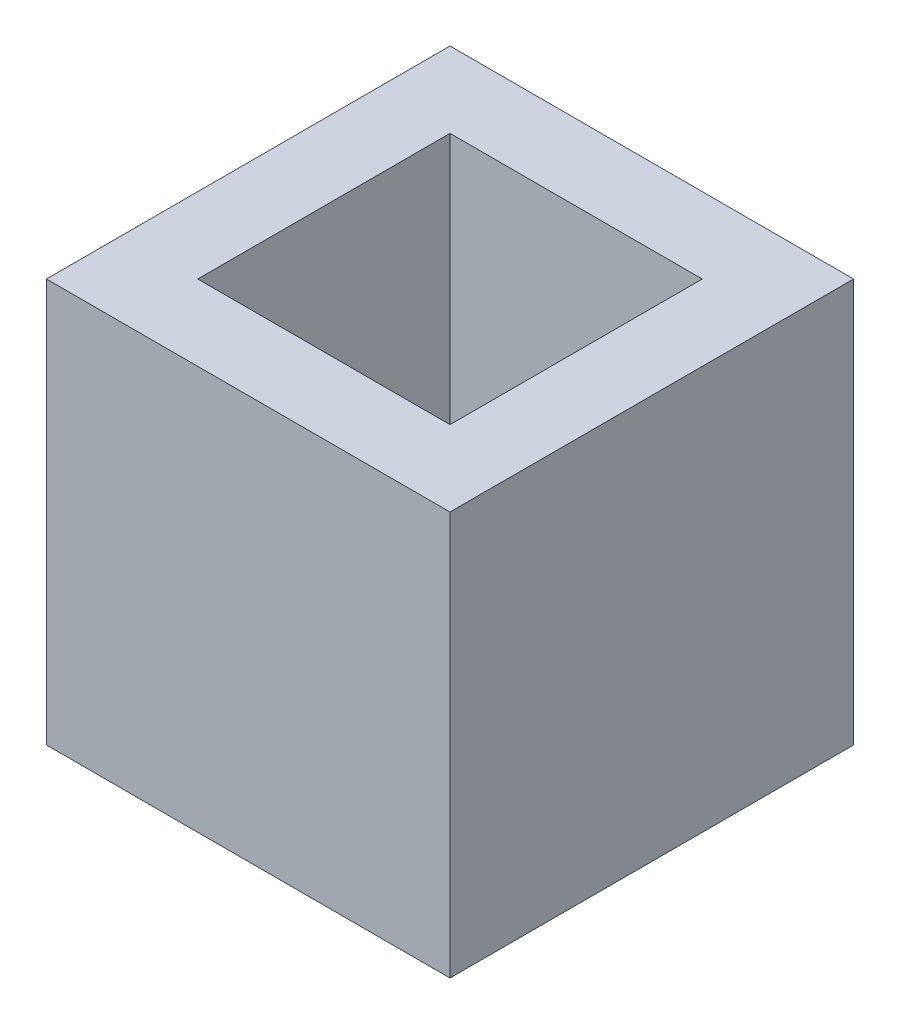
ISO-10303-21;
HEADER;
FILE_DESCRIPTION(('STEP AP214'),'2;1');
FILE_NAME('part.step','',(''),(''),'','','');
FILE_SCHEMA(('AUTOMOTIVE_DESIGN { 1 0 10303 214 1 1 1 1 }'));
ENDSEC;
DATA;
#1=APPLICATION_CONTEXT('core data for automotive mechanical design processes');
#2=APPLICATION_PROTOCOL_DEFINITION('international standard','automotive_design',2000,#1);
#3=PRODUCT_CONTEXT('',#1,'mechanical');
#4=PRODUCT('Part','Part','',(#3));
#5=PRODUCT_RELATED_PRODUCT_CATEGORY('part','',(#4));
#6=PRODUCT_DEFINITION_FORMATION('','',#4);
#7=PRODUCT_DEFINITION_CONTEXT('part definition',#1,'design');
#8=PRODUCT_DEFINITION('design','',#6,#7);
#9=PRODUCT_DEFINITION_SHAPE('','',#8);
#10=(LENGTH_UNIT() NAMED_UNIT(*) SI_UNIT(.MILLI.,.METRE.));
#11=(NAMED_UNIT(*) PLANE_ANGLE_UNIT() SI_UNIT($,.RADIAN.));
#12=(NAMED_UNIT(*) SI_UNIT($,.STERADIAN.) SOLID_ANGLE_UNIT());
#13=UNCERTAINTY_MEASURE_WITH_UNIT(LENGTH_MEASURE(1.E-05),#10,'distance_accuracy_value','');
#14=(GEOMETRIC_REPRESENTATION_CONTEXT(3) GLOBAL_UNCERTAINTY_ASSIGNED_CONTEXT((#13)) GLOBAL_UNIT_ASSIGNED_CONTEXT((#10,
#11,#12)) REPRESENTATION_CONTEXT('',''));
#15=CARTESIAN_POINT('',(0.,0.,0.));
#16=DIRECTION('',(0.,0.,1.));
#17=DIRECTION('',(1.,0.,0.));
#18=AXIS2_PLACEMENT_3D('',#15,#16,#17);
#19=CARTESIAN_POINT('',(0.,25.4,0.));
#20=DIRECTION('',(1.,0.,0.));
#21=DIRECTION('',(0.,0.,-1.));
#22=AXIS2_PLACEMENT_3D('',#19,#20,#21);
#23=PLANE('',#22);
#24=DIRECTION('',(0.,0.,1.));
#25=VECTOR('',#24,1.);
#26=CARTESIAN_POINT('',(0.,0.,0.));
#27=LINE('',#26,#25);
#28=CARTESIAN_POINT('',(0.,0.,-25.4));
#29=VERTEX_POINT('',#28);
#30=CARTESIAN_POINT('',(0.,0.,0.));
#31=VERTEX_POINT('',#30);
#32=EDGE_CURVE('E130',#29,#31,#27,.T.);
#33=ORIENTED_EDGE('',*,*,#32,.T.);
#34=DIRECTION('',(0.,-1.,0.));
#35=VECTOR('',#34,1.);
#36=CARTESIAN_POINT('',(0.,25.4,0.));
#37=LINE('',#36,#35);
#38=CARTESIAN_POINT('',(0.,25.4,0.));
#39=VERTEX_POINT('',#38);
#40=EDGE_CURVE('E11',#39,#31,#37,.T.);
#41=ORIENTED_EDGE('',*,*,#40,.F.);
#42=DIRECTION('',(0.,0.,1.));
#43=VECTOR('',#42,1.);
#44=CARTESIAN_POINT('',(0.,25.4,0.));
#45=LINE('',#44,#43);
#46=CARTESIAN_POINT('',(0.,25.4,-25.4));
#47=VERTEX_POINT('',#46);
#48=EDGE_CURVE('E134',#47,#39,#45,.T.);
#49=ORIENTED_EDGE('',*,*,#48,.F.);
#50=DIRECTION('',(0.,-1.,0.));
#51=VECTOR('',#50,1.);
#52=CARTESIAN_POINT('',(0.,25.4,-25.4));
#53=LINE('',#52,#51);
#54=EDGE_CURVE('E144',#47,#29,#53,.T.);
#55=ORIENTED_EDGE('',*,*,#54,.T.);
#56=EDGE_LOOP('',(#33,#41,#49,#55));
#57=FACE_BOUND('',#56,.T.);
#58=ADVANCED_FACE('F33',(#57),#23,.F.);
#59=CARTESIAN_POINT('',(0.,25.4,0.));
#60=DIRECTION('',(0.,0.,-1.));
#61=DIRECTION('',(-1.,0.,0.));
#62=AXIS2_PLACEMENT_3D('',#59,#60,#61);
#63=PLANE('',#62);
#64=DIRECTION('',(1.,0.,0.));
#65=VECTOR('',#64,1.);
#66=CARTESIAN_POINT('',(0.,0.,0.));
#67=LINE('',#66,#65);
#68=CARTESIAN_POINT('',(25.4,0.,0.));
#69=VERTEX_POINT('',#68);
#70=EDGE_CURVE('E147',#31,#69,#67,.T.);
#71=ORIENTED_EDGE('',*,*,#70,.T.);
#72=DIRECTION('',(0.,-1.,0.));
#73=VECTOR('',#72,1.);
#74=CARTESIAN_POINT('',(25.4,25.4,0.));
#75=LINE('',#74,#73);
#76=CARTESIAN_POINT('',(25.4,25.4,0.));
#77=VERTEX_POINT('',#76);
#78=EDGE_CURVE('E40',#77,#69,#75,.T.);
#79=ORIENTED_EDGE('',*,*,#78,.F.);
#80=DIRECTION('',(1.,0.,0.));
#81=VECTOR('',#80,1.);
#82=CARTESIAN_POINT('',(0.,25.4,0.));
#83=LINE('',#82,#81);
#84=EDGE_CURVE('E137',#39,#77,#83,.T.);
#85=ORIENTED_EDGE('',*,*,#84,.F.);
#86=ORIENTED_EDGE('',*,*,#40,.T.);
#87=EDGE_LOOP('',(#71,#79,#85,#86));
#88=FACE_BOUND('',#87,.T.);
#89=ADVANCED_FACE('F175',(#88),#63,.F.);
#90=CARTESIAN_POINT('',(25.4,25.4,0.));
#91=DIRECTION('',(-1.,0.,0.));
#92=DIRECTION('',(0.,0.,1.));
#93=AXIS2_PLACEMENT_3D('',#90,#91,#92);
#94=PLANE('',#93);
#95=DIRECTION('',(0.,0.,-1.));
#96=VECTOR('',#95,1.);
#97=CARTESIAN_POINT('',(25.4,0.,0.));
#98=LINE('',#97,#96);
#99=CARTESIAN_POINT('',(25.4,0.,-25.4));
#100=VERTEX_POINT('',#99);
#101=EDGE_CURVE('E149',#69,#100,#98,.T.);
#102=ORIENTED_EDGE('',*,*,#101,.T.);
#103=DIRECTION('',(0.,-1.,0.));
#104=VECTOR('',#103,1.);
#105=CARTESIAN_POINT('',(25.4,25.4,-25.4));
#106=LINE('',#105,#104);
#107=CARTESIAN_POINT('',(25.4,25.4,-25.4));
#108=VERTEX_POINT('',#107);
#109=EDGE_CURVE('E154',#108,#100,#106,.T.);
#110=ORIENTED_EDGE('',*,*,#109,.F.);
#111=DIRECTION('',(0.,0.,-1.));
#112=VECTOR('',#111,1.);
#113=CARTESIAN_POINT('',(25.4,25.4,0.));
#114=LINE('',#113,#112);
#115=EDGE_CURVE('E140',#77,#108,#114,.T.);
#116=ORIENTED_EDGE('',*,*,#115,.F.);
#117=ORIENTED_EDGE('',*,*,#78,.T.);
#118=EDGE_LOOP('',(#102,#110,#116,#117));
#119=FACE_BOUND('',#118,.T.);
#120=ADVANCED_FACE('F161',(#119),#94,.F.);
#121=CARTESIAN_POINT('',(0.,25.4,-25.4));
#122=DIRECTION('',(0.,0.,1.));
#123=DIRECTION('',(1.,0.,0.));
#124=AXIS2_PLACEMENT_3D('',#121,#122,#123);
#125=PLANE('',#124);
#126=DIRECTION('',(-1.,0.,0.));
#127=VECTOR('',#126,1.);
#128=CARTESIAN_POINT('',(0.,0.,-25.4));
#129=LINE('',#128,#127);
#130=EDGE_CURVE('E138',#100,#29,#129,.T.);
#131=ORIENTED_EDGE('',*,*,#130,.T.);
#132=ORIENTED_EDGE('',*,*,#54,.F.);
#133=DIRECTION('',(-1.,0.,0.));
#134=VECTOR('',#133,1.);
#135=CARTESIAN_POINT('',(0.,25.4,-25.4));
#136=LINE('',#135,#134);
#137=EDGE_CURVE('E142',#108,#47,#136,.T.);
#138=ORIENTED_EDGE('',*,*,#137,.F.);
#139=ORIENTED_EDGE('',*,*,#109,.T.);
#140=EDGE_LOOP('',(#131,#132,#138,#139));
#141=FACE_BOUND('',#140,.T.);
#142=ADVANCED_FACE('F168',(#141),#125,.F.);
#143=CARTESIAN_POINT('',(0.,25.4,0.));
#144=DIRECTION('',(0.,-1.,0.));
#145=DIRECTION('',(0.,0.,-1.));
#146=AXIS2_PLACEMENT_3D('',#143,#144,#145);
#147=PLANE('',#146);
#148=DIRECTION('',(-1.,0.,0.));
#149=VECTOR('',#148,1.);
#150=CARTESIAN_POINT('',(4.7625,25.4,-20.6375));
#151=LINE('',#150,#149);
#152=CARTESIAN_POINT('',(20.6375,25.4,-20.6375));
#153=VERTEX_POINT('',#152);
#154=CARTESIAN_POINT('',(4.7625,25.4,-20.6375));
#155=VERTEX_POINT('',#154);
#156=EDGE_CURVE('E124',#153,#155,#151,.T.);
#157=ORIENTED_EDGE('',*,*,#156,.F.);
#158=DIRECTION('',(0.,0.,-1.));
#159=VECTOR('',#158,1.);
#160=CARTESIAN_POINT('',(20.6375,25.4,-4.7625));
#161=LINE('',#160,#159);
#162=CARTESIAN_POINT('',(20.6375,25.4,-4.7625));
#163=VERTEX_POINT('',#162);
#164=EDGE_CURVE('E47',#163,#153,#161,.T.);
#165=ORIENTED_EDGE('',*,*,#164,.F.);
#166=DIRECTION('',(1.,0.,0.));
#167=VECTOR('',#166,1.);
#168=CARTESIAN_POINT('',(4.7625,25.4,-4.7625));
#169=LINE('',#168,#167);
#170=CARTESIAN_POINT('',(4.7625,25.4,-4.7625));
#171=VERTEX_POINT('',#170);
#172=EDGE_CURVE('E115',#171,#163,#169,.T.);
#173=ORIENTED_EDGE('',*,*,#172,.F.);
#174=DIRECTION('',(0.,0.,1.));
#175=VECTOR('',#174,1.);
#176=CARTESIAN_POINT('',(4.7625,25.4,-4.7625));
#177=LINE('',#176,#175);
#178=EDGE_CURVE('E118',#155,#171,#177,.T.);
#179=ORIENTED_EDGE('',*,*,#178,.F.);
#180=EDGE_LOOP('',(#157,#165,#173,#179));
#181=FACE_BOUND('',#180,.T.);
#182=ORIENTED_EDGE('',*,*,#48,.T.);
#183=ORIENTED_EDGE('',*,*,#84,.T.);
#184=ORIENTED_EDGE('',*,*,#115,.T.);
#185=ORIENTED_EDGE('',*,*,#137,.T.);
#186=EDGE_LOOP('',(#182,#183,#184,#185));
#187=FACE_BOUND('',#186,.T.);
#188=ADVANCED_FACE('F174',(#181,#187),#147,.F.);
#189=CARTESIAN_POINT('',(0.,0.,0.));
#190=DIRECTION('',(0.,-1.,0.));
#191=DIRECTION('',(0.,0.,-1.));
#192=AXIS2_PLACEMENT_3D('',#189,#190,#191);
#193=PLANE('',#192);
#194=DIRECTION('',(0.,0.,-1.));
#195=VECTOR('',#194,1.);
#196=CARTESIAN_POINT('',(20.6375,0.,-4.7625));
#197=LINE('',#196,#195);
#198=CARTESIAN_POINT('',(20.6375,0.,-4.7625));
#199=VERTEX_POINT('',#198);
#200=CARTESIAN_POINT('',(20.6375,0.,-20.6375));
#201=VERTEX_POINT('',#200);
#202=EDGE_CURVE('E99',#199,#201,#197,.T.);
#203=ORIENTED_EDGE('',*,*,#202,.T.);
#204=DIRECTION('',(-1.,0.,0.));
#205=VECTOR('',#204,1.);
#206=CARTESIAN_POINT('',(4.7625,0.,-20.6375));
#207=LINE('',#206,#205);
#208=CARTESIAN_POINT('',(4.7625,0.,-20.6375));
#209=VERTEX_POINT('',#208);
#210=EDGE_CURVE('E108',#201,#209,#207,.T.);
#211=ORIENTED_EDGE('',*,*,#210,.T.);
#212=DIRECTION('',(0.,0.,1.));
#213=VECTOR('',#212,1.);
#214=CARTESIAN_POINT('',(4.7625,0.,-4.7625));
#215=LINE('',#214,#213);
#216=CARTESIAN_POINT('',(4.7625,0.,-4.7625));
#217=VERTEX_POINT('',#216);
#218=EDGE_CURVE('E55',#209,#217,#215,.T.);
#219=ORIENTED_EDGE('',*,*,#218,.T.);
#220=DIRECTION('',(1.,0.,0.));
#221=VECTOR('',#220,1.);
#222=CARTESIAN_POINT('',(4.7625,0.,-4.7625));
#223=LINE('',#222,#221);
#224=EDGE_CURVE('E105',#217,#199,#223,.T.);
#225=ORIENTED_EDGE('',*,*,#224,.T.);
#226=EDGE_LOOP('',(#203,#211,#219,#225));
#227=FACE_BOUND('',#226,.T.);
#228=ORIENTED_EDGE('',*,*,#32,.F.);
#229=ORIENTED_EDGE('',*,*,#130,.F.);
#230=ORIENTED_EDGE('',*,*,#101,.F.);
#231=ORIENTED_EDGE('',*,*,#70,.F.);
#232=EDGE_LOOP('',(#228,#229,#230,#231));
#233=FACE_BOUND('',#232,.T.);
#234=ADVANCED_FACE('F112',(#227,#233),#193,.T.);
#235=CARTESIAN_POINT('',(20.6375,0.,-4.7625));
#236=DIRECTION('',(1.,0.,0.));
#237=DIRECTION('',(0.,0.,-1.));
#238=AXIS2_PLACEMENT_3D('',#235,#236,#237);
#239=PLANE('',#238);
#240=ORIENTED_EDGE('',*,*,#164,.T.);
#241=DIRECTION('',(0.,1.,0.));
#242=VECTOR('',#241,1.);
#243=CARTESIAN_POINT('',(20.6375,0.,-20.6375));
#244=LINE('',#243,#242);
#245=EDGE_CURVE('E95',#201,#153,#244,.T.);
#246=ORIENTED_EDGE('',*,*,#245,.F.);
#247=ORIENTED_EDGE('',*,*,#202,.F.);
#248=DIRECTION('',(0.,1.,0.));
#249=VECTOR('',#248,1.);
#250=CARTESIAN_POINT('',(20.6375,0.,-4.7625));
#251=LINE('',#250,#249);
#252=EDGE_CURVE('E128',#199,#163,#251,.T.);
#253=ORIENTED_EDGE('',*,*,#252,.T.);
#254=EDGE_LOOP('',(#240,#246,#247,#253));
#255=FACE_BOUND('',#254,.T.);
#256=ADVANCED_FACE('F97',(#255),#239,.F.);
#257=CARTESIAN_POINT('',(4.7625,0.,-4.7625));
#258=DIRECTION('',(0.,0.,1.));
#259=DIRECTION('',(1.,0.,0.));
#260=AXIS2_PLACEMENT_3D('',#257,#258,#259);
#261=PLANE('',#260);
#262=ORIENTED_EDGE('',*,*,#172,.T.);
#263=ORIENTED_EDGE('',*,*,#252,.F.);
#264=ORIENTED_EDGE('',*,*,#224,.F.);
#265=DIRECTION('',(0.,1.,0.));
#266=VECTOR('',#265,1.);
#267=CARTESIAN_POINT('',(4.7625,0.,-4.7625));
#268=LINE('',#267,#266);
#269=EDGE_CURVE('E131',#217,#171,#268,.T.);
#270=ORIENTED_EDGE('',*,*,#269,.T.);
#271=EDGE_LOOP('',(#262,#263,#264,#270));
#272=FACE_BOUND('',#271,.T.);
#273=ADVANCED_FACE('F192',(#272),#261,.F.);
#274=CARTESIAN_POINT('',(4.7625,0.,-4.7625));
#275=DIRECTION('',(-1.,0.,0.));
#276=DIRECTION('',(0.,0.,1.));
#277=AXIS2_PLACEMENT_3D('',#274,#275,#276);
#278=PLANE('',#277);
#279=ORIENTED_EDGE('',*,*,#178,.T.);
#280=ORIENTED_EDGE('',*,*,#269,.F.);
#281=ORIENTED_EDGE('',*,*,#218,.F.);
#282=DIRECTION('',(0.,1.,0.));
#283=VECTOR('',#282,1.);
#284=CARTESIAN_POINT('',(4.7625,0.,-20.6375));
#285=LINE('',#284,#283);
#286=EDGE_CURVE('E104',#209,#155,#285,.T.);
#287=ORIENTED_EDGE('',*,*,#286,.T.);
#288=EDGE_LOOP('',(#279,#280,#281,#287));
#289=FACE_BOUND('',#288,.T.);
#290=ADVANCED_FACE('F195',(#289),#278,.F.);
#291=CARTESIAN_POINT('',(4.7625,0.,-20.6375));
#292=DIRECTION('',(0.,0.,-1.));
#293=DIRECTION('',(-1.,0.,0.));
#294=AXIS2_PLACEMENT_3D('',#291,#292,#293);
#295=PLANE('',#294);
#296=ORIENTED_EDGE('',*,*,#156,.T.);
#297=ORIENTED_EDGE('',*,*,#286,.F.);
#298=ORIENTED_EDGE('',*,*,#210,.F.);
#299=ORIENTED_EDGE('',*,*,#245,.T.);
#300=EDGE_LOOP('',(#296,#297,#298,#299));
#301=FACE_BOUND('',#300,.T.);
#302=ADVANCED_FACE('F109',(#301),#295,.F.);
#303=CLOSED_SHELL('',(#58,#89,#120,#142,#188,#234,#256,#273,#290,#302));
#304=MANIFOLD_SOLID_BREP('B2',#303);
#305=ADVANCED_BREP_SHAPE_REPRESENTATION('',(#18,#304),#14);
#306=SHAPE_DEFINITION_REPRESENTATION(#9,#305);
ENDSEC;
END-ISO-10303-21;
